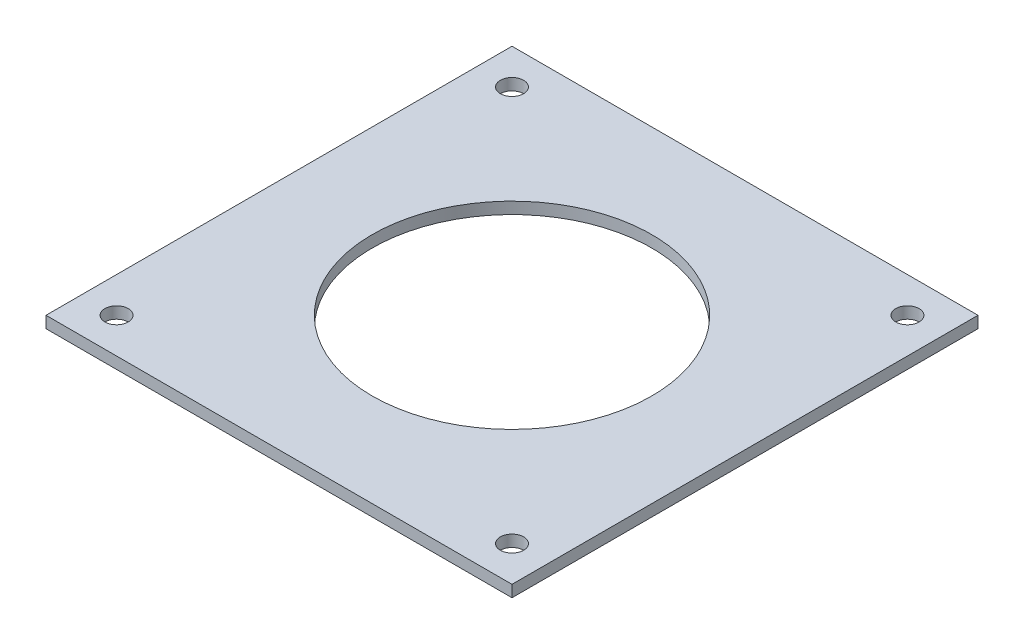
ISO-10303-21;
HEADER;
FILE_DESCRIPTION(('STEP AP214'),'2;1');
FILE_NAME('part.step','',(''),(''),'','','');
FILE_SCHEMA(('AUTOMOTIVE_DESIGN { 1 0 10303 214 1 1 1 1 }'));
ENDSEC;
DATA;
#1=APPLICATION_CONTEXT('core data for automotive mechanical design processes');
#2=APPLICATION_PROTOCOL_DEFINITION('international standard','automotive_design',2000,#1);
#3=PRODUCT_CONTEXT('',#1,'mechanical');
#4=PRODUCT('Part','Part','',(#3));
#5=PRODUCT_RELATED_PRODUCT_CATEGORY('part','',(#4));
#6=PRODUCT_DEFINITION_FORMATION('','',#4);
#7=PRODUCT_DEFINITION_CONTEXT('part definition',#1,'design');
#8=PRODUCT_DEFINITION('design','',#6,#7);
#9=PRODUCT_DEFINITION_SHAPE('','',#8);
#10=(LENGTH_UNIT() NAMED_UNIT(*) SI_UNIT(.MILLI.,.METRE.));
#11=(NAMED_UNIT(*) PLANE_ANGLE_UNIT() SI_UNIT($,.RADIAN.));
#12=(NAMED_UNIT(*) SI_UNIT($,.STERADIAN.) SOLID_ANGLE_UNIT());
#13=UNCERTAINTY_MEASURE_WITH_UNIT(LENGTH_MEASURE(1.E-05),#10,'distance_accuracy_value','');
#14=(GEOMETRIC_REPRESENTATION_CONTEXT(3) GLOBAL_UNCERTAINTY_ASSIGNED_CONTEXT((#13)) GLOBAL_UNIT_ASSIGNED_CONTEXT((#10,
#11,#12)) REPRESENTATION_CONTEXT('',''));
#15=CARTESIAN_POINT('',(0.,0.,0.));
#16=DIRECTION('',(0.,0.,1.));
#17=DIRECTION('',(1.,0.,0.));
#18=AXIS2_PLACEMENT_3D('',#15,#16,#17);
#19=CARTESIAN_POINT('',(0.,3.175,0.));
#20=DIRECTION('',(0.,1.,0.));
#21=DIRECTION('',(0.,0.,1.));
#22=AXIS2_PLACEMENT_3D('',#19,#20,#21);
#23=PLANE('',#22);
#24=CARTESIAN_POINT('',(53.881536726418,3.175,53.8815367264118));
#25=DIRECTION('',(0.,1.,0.));
#26=DIRECTION('',(0.,0.,1.));
#27=AXIS2_PLACEMENT_3D('',#24,#25,#26);
#28=CIRCLE('',#27,3.17500000000431);
#29=CARTESIAN_POINT('',(53.881536726418,3.175,57.0565367264161));
#30=VERTEX_POINT('',#29);
#31=EDGE_CURVE('E131',#30,#30,#28,.T.);
#32=ORIENTED_EDGE('',*,*,#31,.F.);
#33=EDGE_LOOP('',(#32));
#34=FACE_BOUND('',#33,.T.);
#35=CARTESIAN_POINT('',(-53.8815367264149,3.175,-53.8815367264149));
#36=DIRECTION('',(0.,1.,0.));
#37=DIRECTION('',(0.,0.,1.));
#38=AXIS2_PLACEMENT_3D('',#35,#36,#37);
#39=CIRCLE('',#38,3.175);
#40=CARTESIAN_POINT('',(-53.8815367264149,3.175,-50.7065367264149));
#41=VERTEX_POINT('',#40);
#42=EDGE_CURVE('E119',#41,#41,#39,.T.);
#43=ORIENTED_EDGE('',*,*,#42,.F.);
#44=EDGE_LOOP('',(#43));
#45=FACE_BOUND('',#44,.T.);
#46=DIRECTION('',(0.,0.,1.));
#47=VECTOR('',#46,1.);
#48=CARTESIAN_POINT('',(-63.5,3.175,63.5));
#49=LINE('',#48,#47);
#50=CARTESIAN_POINT('',(-63.5,3.175,-63.5));
#51=VERTEX_POINT('',#50);
#52=CARTESIAN_POINT('',(-63.5,3.175,63.5));
#53=VERTEX_POINT('',#52);
#54=EDGE_CURVE('E89',#51,#53,#49,.T.);
#55=ORIENTED_EDGE('',*,*,#54,.T.);
#56=DIRECTION('',(1.,0.,0.));
#57=VECTOR('',#56,1.);
#58=CARTESIAN_POINT('',(63.5,3.175,63.5));
#59=LINE('',#58,#57);
#60=CARTESIAN_POINT('',(63.5,3.175,63.5));
#61=VERTEX_POINT('',#60);
#62=EDGE_CURVE('E84',#53,#61,#59,.T.);
#63=ORIENTED_EDGE('',*,*,#62,.T.);
#64=DIRECTION('',(0.,0.,-1.));
#65=VECTOR('',#64,1.);
#66=CARTESIAN_POINT('',(63.5,3.175,63.5));
#67=LINE('',#66,#65);
#68=CARTESIAN_POINT('',(63.5,3.175,-63.5));
#69=VERTEX_POINT('',#68);
#70=EDGE_CURVE('E87',#61,#69,#67,.T.);
#71=ORIENTED_EDGE('',*,*,#70,.T.);
#72=DIRECTION('',(-1.,0.,0.));
#73=VECTOR('',#72,1.);
#74=CARTESIAN_POINT('',(63.5,3.175,-63.5));
#75=LINE('',#74,#73);
#76=EDGE_CURVE('E54',#69,#51,#75,.T.);
#77=ORIENTED_EDGE('',*,*,#76,.T.);
#78=EDGE_LOOP('',(#55,#63,#71,#77));
#79=FACE_BOUND('',#78,.T.);
#80=CARTESIAN_POINT('',(0.,3.175,0.));
#81=DIRECTION('',(0.,1.,0.));
#82=DIRECTION('',(0.,0.,1.));
#83=AXIS2_PLACEMENT_3D('',#80,#81,#82);
#84=CIRCLE('',#83,38.1);
#85=CARTESIAN_POINT('',(0.,3.175,38.1));
#86=VERTEX_POINT('',#85);
#87=EDGE_CURVE('E104',#86,#86,#84,.T.);
#88=ORIENTED_EDGE('',*,*,#87,.F.);
#89=EDGE_LOOP('',(#88));
#90=FACE_BOUND('',#89,.T.);
#91=CARTESIAN_POINT('',(53.8815367264149,3.175,-53.881536726418));
#92=DIRECTION('',(0.,1.,0.));
#93=DIRECTION('',(0.,0.,1.));
#94=AXIS2_PLACEMENT_3D('',#91,#92,#93);
#95=CIRCLE('',#94,3.17500000000319);
#96=CARTESIAN_POINT('',(53.8815367264149,3.175,-50.7065367264148));
#97=VERTEX_POINT('',#96);
#98=EDGE_CURVE('E125',#97,#97,#95,.T.);
#99=ORIENTED_EDGE('',*,*,#98,.F.);
#100=EDGE_LOOP('',(#99));
#101=FACE_BOUND('',#100,.T.);
#102=CARTESIAN_POINT('',(-53.8815367264118,3.175,53.8815367264149));
#103=DIRECTION('',(0.,1.,0.));
#104=DIRECTION('',(0.,0.,1.));
#105=AXIS2_PLACEMENT_3D('',#102,#103,#104);
#106=CIRCLE('',#105,3.17500000000161);
#107=CARTESIAN_POINT('',(-53.8815367264118,3.175,57.0565367264165));
#108=VERTEX_POINT('',#107);
#109=EDGE_CURVE('E137',#108,#108,#106,.T.);
#110=ORIENTED_EDGE('',*,*,#109,.F.);
#111=EDGE_LOOP('',(#110));
#112=FACE_BOUND('',#111,.T.);
#113=ADVANCED_FACE('F37',(#34,#45,#79,#90,#101,#112),#23,.T.);
#114=CARTESIAN_POINT('',(0.,0.,0.));
#115=DIRECTION('',(0.,1.,0.));
#116=DIRECTION('',(0.,0.,1.));
#117=AXIS2_PLACEMENT_3D('',#114,#115,#116);
#118=PLANE('',#117);
#119=DIRECTION('',(0.,0.,1.));
#120=VECTOR('',#119,1.);
#121=CARTESIAN_POINT('',(-63.5,0.,63.5));
#122=LINE('',#121,#120);
#123=CARTESIAN_POINT('',(-63.5,0.,-63.5));
#124=VERTEX_POINT('',#123);
#125=CARTESIAN_POINT('',(-63.5,0.,63.5));
#126=VERTEX_POINT('',#125);
#127=EDGE_CURVE('E101',#124,#126,#122,.T.);
#128=ORIENTED_EDGE('',*,*,#127,.F.);
#129=DIRECTION('',(-1.,0.,0.));
#130=VECTOR('',#129,1.);
#131=CARTESIAN_POINT('',(63.5,0.,-63.5));
#132=LINE('',#131,#130);
#133=CARTESIAN_POINT('',(63.5,0.,-63.5));
#134=VERTEX_POINT('',#133);
#135=EDGE_CURVE('E77',#134,#124,#132,.T.);
#136=ORIENTED_EDGE('',*,*,#135,.F.);
#137=DIRECTION('',(0.,0.,-1.));
#138=VECTOR('',#137,1.);
#139=CARTESIAN_POINT('',(63.5,0.,63.5));
#140=LINE('',#139,#138);
#141=CARTESIAN_POINT('',(63.5,0.,63.5));
#142=VERTEX_POINT('',#141);
#143=EDGE_CURVE('E71',#142,#134,#140,.T.);
#144=ORIENTED_EDGE('',*,*,#143,.F.);
#145=DIRECTION('',(1.,0.,0.));
#146=VECTOR('',#145,1.);
#147=CARTESIAN_POINT('',(63.5,0.,63.5));
#148=LINE('',#147,#146);
#149=EDGE_CURVE('E93',#126,#142,#148,.T.);
#150=ORIENTED_EDGE('',*,*,#149,.F.);
#151=EDGE_LOOP('',(#128,#136,#144,#150));
#152=FACE_BOUND('',#151,.T.);
#153=CARTESIAN_POINT('',(0.,0.,0.));
#154=DIRECTION('',(0.,1.,0.));
#155=DIRECTION('',(0.,0.,1.));
#156=AXIS2_PLACEMENT_3D('',#153,#154,#155);
#157=CIRCLE('',#156,38.1);
#158=CARTESIAN_POINT('',(0.,0.,38.1));
#159=VERTEX_POINT('',#158);
#160=EDGE_CURVE('E116',#159,#159,#157,.T.);
#161=ORIENTED_EDGE('',*,*,#160,.T.);
#162=EDGE_LOOP('',(#161));
#163=FACE_BOUND('',#162,.T.);
#164=CARTESIAN_POINT('',(-53.8815367264149,0.,-53.8815367264149));
#165=DIRECTION('',(0.,1.,0.));
#166=DIRECTION('',(0.,0.,1.));
#167=AXIS2_PLACEMENT_3D('',#164,#165,#166);
#168=CIRCLE('',#167,3.175);
#169=CARTESIAN_POINT('',(-53.8815367264149,0.,-50.7065367264149));
#170=VERTEX_POINT('',#169);
#171=EDGE_CURVE('E122',#170,#170,#168,.T.);
#172=ORIENTED_EDGE('',*,*,#171,.T.);
#173=EDGE_LOOP('',(#172));
#174=FACE_BOUND('',#173,.T.);
#175=CARTESIAN_POINT('',(53.8815367264149,0.,-53.881536726418));
#176=DIRECTION('',(0.,1.,0.));
#177=DIRECTION('',(0.,0.,1.));
#178=AXIS2_PLACEMENT_3D('',#175,#176,#177);
#179=CIRCLE('',#178,3.17500000000319);
#180=CARTESIAN_POINT('',(53.8815367264149,0.,-50.7065367264148));
#181=VERTEX_POINT('',#180);
#182=EDGE_CURVE('E128',#181,#181,#179,.T.);
#183=ORIENTED_EDGE('',*,*,#182,.T.);
#184=EDGE_LOOP('',(#183));
#185=FACE_BOUND('',#184,.T.);
#186=CARTESIAN_POINT('',(53.881536726418,0.,53.8815367264118));
#187=DIRECTION('',(0.,1.,0.));
#188=DIRECTION('',(0.,0.,1.));
#189=AXIS2_PLACEMENT_3D('',#186,#187,#188);
#190=CIRCLE('',#189,3.17500000000431);
#191=CARTESIAN_POINT('',(53.881536726418,0.,57.0565367264161));
#192=VERTEX_POINT('',#191);
#193=EDGE_CURVE('E134',#192,#192,#190,.T.);
#194=ORIENTED_EDGE('',*,*,#193,.T.);
#195=EDGE_LOOP('',(#194));
#196=FACE_BOUND('',#195,.T.);
#197=CARTESIAN_POINT('',(-53.8815367264118,0.,53.8815367264149));
#198=DIRECTION('',(0.,1.,0.));
#199=DIRECTION('',(0.,0.,1.));
#200=AXIS2_PLACEMENT_3D('',#197,#198,#199);
#201=CIRCLE('',#200,3.17500000000161);
#202=CARTESIAN_POINT('',(-53.8815367264118,0.,57.0565367264165));
#203=VERTEX_POINT('',#202);
#204=EDGE_CURVE('E140',#203,#203,#201,.T.);
#205=ORIENTED_EDGE('',*,*,#204,.T.);
#206=EDGE_LOOP('',(#205));
#207=FACE_BOUND('',#206,.T.);
#208=ADVANCED_FACE('F112',(#152,#163,#174,#185,#196,#207),#118,.F.);
#209=CARTESIAN_POINT('',(-63.5,3.175,63.5));
#210=DIRECTION('',(1.,0.,0.));
#211=DIRECTION('',(0.,0.,-1.));
#212=AXIS2_PLACEMENT_3D('',#209,#210,#211);
#213=PLANE('',#212);
#214=ORIENTED_EDGE('',*,*,#127,.T.);
#215=DIRECTION('',(0.,-1.,0.));
#216=VECTOR('',#215,1.);
#217=CARTESIAN_POINT('',(-63.5,3.175,63.5));
#218=LINE('',#217,#216);
#219=EDGE_CURVE('E11',#53,#126,#218,.T.);
#220=ORIENTED_EDGE('',*,*,#219,.F.);
#221=ORIENTED_EDGE('',*,*,#54,.F.);
#222=DIRECTION('',(0.,-1.,0.));
#223=VECTOR('',#222,1.);
#224=CARTESIAN_POINT('',(-63.5,3.175,-63.5));
#225=LINE('',#224,#223);
#226=EDGE_CURVE('E97',#51,#124,#225,.T.);
#227=ORIENTED_EDGE('',*,*,#226,.T.);
#228=EDGE_LOOP('',(#214,#220,#221,#227));
#229=FACE_BOUND('',#228,.T.);
#230=ADVANCED_FACE('F39',(#229),#213,.F.);
#231=CARTESIAN_POINT('',(63.5,3.175,63.5));
#232=DIRECTION('',(0.,0.,-1.));
#233=DIRECTION('',(-1.,0.,0.));
#234=AXIS2_PLACEMENT_3D('',#231,#232,#233);
#235=PLANE('',#234);
#236=ORIENTED_EDGE('',*,*,#149,.T.);
#237=DIRECTION('',(0.,-1.,0.));
#238=VECTOR('',#237,1.);
#239=CARTESIAN_POINT('',(63.5,3.175,63.5));
#240=LINE('',#239,#238);
#241=EDGE_CURVE('E46',#61,#142,#240,.T.);
#242=ORIENTED_EDGE('',*,*,#241,.F.);
#243=ORIENTED_EDGE('',*,*,#62,.F.);
#244=ORIENTED_EDGE('',*,*,#219,.T.);
#245=EDGE_LOOP('',(#236,#242,#243,#244));
#246=FACE_BOUND('',#245,.T.);
#247=ADVANCED_FACE('F92',(#246),#235,.F.);
#248=CARTESIAN_POINT('',(63.5,3.175,63.5));
#249=DIRECTION('',(-1.,0.,0.));
#250=DIRECTION('',(0.,0.,1.));
#251=AXIS2_PLACEMENT_3D('',#248,#249,#250);
#252=PLANE('',#251);
#253=ORIENTED_EDGE('',*,*,#143,.T.);
#254=DIRECTION('',(0.,-1.,0.));
#255=VECTOR('',#254,1.);
#256=CARTESIAN_POINT('',(63.5,3.175,-63.5));
#257=LINE('',#256,#255);
#258=EDGE_CURVE('E94',#69,#134,#257,.T.);
#259=ORIENTED_EDGE('',*,*,#258,.F.);
#260=ORIENTED_EDGE('',*,*,#70,.F.);
#261=ORIENTED_EDGE('',*,*,#241,.T.);
#262=EDGE_LOOP('',(#253,#259,#260,#261));
#263=FACE_BOUND('',#262,.T.);
#264=ADVANCED_FACE('F95',(#263),#252,.F.);
#265=CARTESIAN_POINT('',(63.5,3.175,-63.5));
#266=DIRECTION('',(0.,0.,1.));
#267=DIRECTION('',(1.,0.,0.));
#268=AXIS2_PLACEMENT_3D('',#265,#266,#267);
#269=PLANE('',#268);
#270=ORIENTED_EDGE('',*,*,#135,.T.);
#271=ORIENTED_EDGE('',*,*,#226,.F.);
#272=ORIENTED_EDGE('',*,*,#76,.F.);
#273=ORIENTED_EDGE('',*,*,#258,.T.);
#274=EDGE_LOOP('',(#270,#271,#272,#273));
#275=FACE_BOUND('',#274,.T.);
#276=ADVANCED_FACE('F109',(#275),#269,.F.);
#277=CARTESIAN_POINT('',(0.,3.175,0.));
#278=DIRECTION('',(0.,-1.,0.));
#279=DIRECTION('',(0.,0.,-1.));
#280=AXIS2_PLACEMENT_3D('',#277,#278,#279);
#281=CYLINDRICAL_SURFACE('',#280,38.1);
#282=ORIENTED_EDGE('',*,*,#87,.T.);
#283=EDGE_LOOP('',(#282));
#284=FACE_BOUND('',#283,.T.);
#285=ORIENTED_EDGE('',*,*,#160,.F.);
#286=EDGE_LOOP('',(#285));
#287=FACE_BOUND('',#286,.T.);
#288=ADVANCED_FACE('F159',(#284,#287),#281,.F.);
#289=CARTESIAN_POINT('',(-53.8815367264149,3.175,-53.8815367264149));
#290=DIRECTION('',(0.,-1.,0.));
#291=DIRECTION('',(0.,0.,-1.));
#292=AXIS2_PLACEMENT_3D('',#289,#290,#291);
#293=CYLINDRICAL_SURFACE('',#292,3.175);
#294=ORIENTED_EDGE('',*,*,#42,.T.);
#295=EDGE_LOOP('',(#294));
#296=FACE_BOUND('',#295,.T.);
#297=ORIENTED_EDGE('',*,*,#171,.F.);
#298=EDGE_LOOP('',(#297));
#299=FACE_BOUND('',#298,.T.);
#300=ADVANCED_FACE('F205',(#296,#299),#293,.F.);
#301=CARTESIAN_POINT('',(53.8815367264149,3.175,-53.881536726418));
#302=DIRECTION('',(0.,-1.,0.));
#303=DIRECTION('',(0.,0.,-1.));
#304=AXIS2_PLACEMENT_3D('',#301,#302,#303);
#305=CYLINDRICAL_SURFACE('',#304,3.17500000000319);
#306=ORIENTED_EDGE('',*,*,#98,.T.);
#307=EDGE_LOOP('',(#306));
#308=FACE_BOUND('',#307,.T.);
#309=ORIENTED_EDGE('',*,*,#182,.F.);
#310=EDGE_LOOP('',(#309));
#311=FACE_BOUND('',#310,.T.);
#312=ADVANCED_FACE('F213',(#308,#311),#305,.F.);
#313=CARTESIAN_POINT('',(53.881536726418,3.175,53.8815367264118));
#314=DIRECTION('',(0.,-1.,0.));
#315=DIRECTION('',(0.,0.,-1.));
#316=AXIS2_PLACEMENT_3D('',#313,#314,#315);
#317=CYLINDRICAL_SURFACE('',#316,3.17500000000431);
#318=ORIENTED_EDGE('',*,*,#31,.T.);
#319=EDGE_LOOP('',(#318));
#320=FACE_BOUND('',#319,.T.);
#321=ORIENTED_EDGE('',*,*,#193,.F.);
#322=EDGE_LOOP('',(#321));
#323=FACE_BOUND('',#322,.T.);
#324=ADVANCED_FACE('F221',(#320,#323),#317,.F.);
#325=CARTESIAN_POINT('',(-53.8815367264118,3.175,53.8815367264149));
#326=DIRECTION('',(0.,-1.,0.));
#327=DIRECTION('',(0.,0.,-1.));
#328=AXIS2_PLACEMENT_3D('',#325,#326,#327);
#329=CYLINDRICAL_SURFACE('',#328,3.17500000000161);
#330=ORIENTED_EDGE('',*,*,#109,.T.);
#331=EDGE_LOOP('',(#330));
#332=FACE_BOUND('',#331,.T.);
#333=ORIENTED_EDGE('',*,*,#204,.F.);
#334=EDGE_LOOP('',(#333));
#335=FACE_BOUND('',#334,.T.);
#336=ADVANCED_FACE('F146',(#332,#335),#329,.F.);
#337=CLOSED_SHELL('',(#113,#208,#230,#247,#264,#276,#288,#300,#312,#324,#336));
#338=MANIFOLD_SOLID_BREP('B2',#337);
#339=ADVANCED_BREP_SHAPE_REPRESENTATION('',(#18,#338),#14);
#340=SHAPE_DEFINITION_REPRESENTATION(#9,#339);
ENDSEC;
END-ISO-10303-21;
